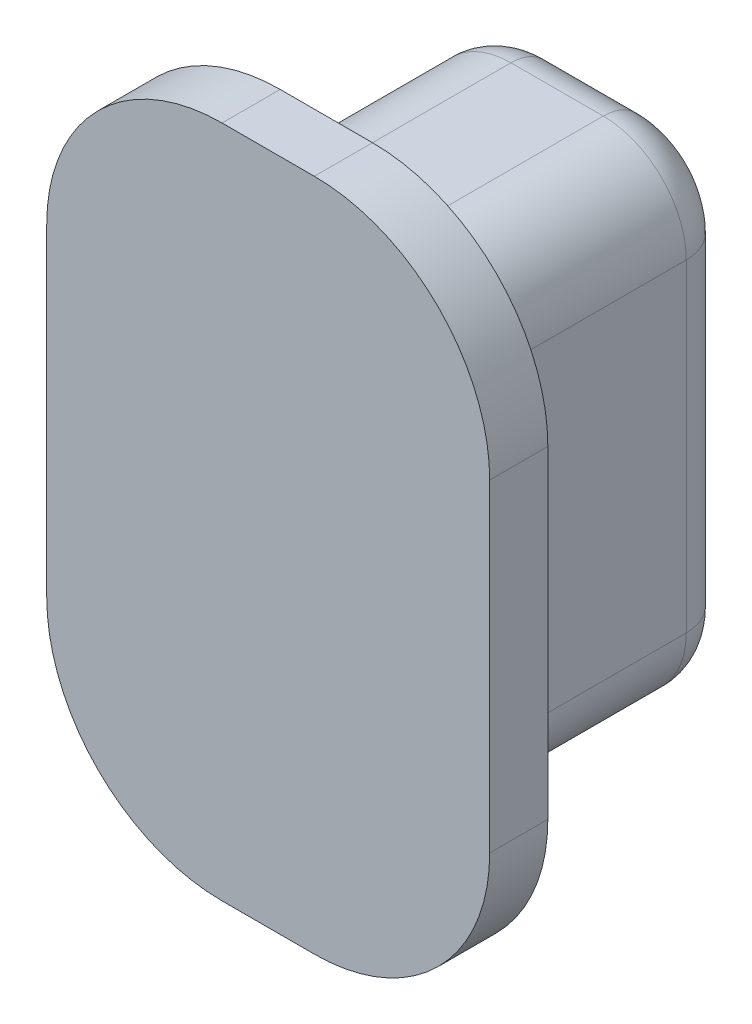
ISO-10303-21;
HEADER;
FILE_DESCRIPTION(('STEP AP214'),'2;1');
FILE_NAME('part.step','',(''),(''),'','','');
FILE_SCHEMA(('AUTOMOTIVE_DESIGN { 1 0 10303 214 1 1 1 1 }'));
ENDSEC;
DATA;
#1=APPLICATION_CONTEXT('core data for automotive mechanical design processes');
#2=APPLICATION_PROTOCOL_DEFINITION('international standard','automotive_design',2000,#1);
#3=PRODUCT_CONTEXT('',#1,'mechanical');
#4=PRODUCT('Part','Part','',(#3));
#5=PRODUCT_RELATED_PRODUCT_CATEGORY('part','',(#4));
#6=PRODUCT_DEFINITION_FORMATION('','',#4);
#7=PRODUCT_DEFINITION_CONTEXT('part definition',#1,'design');
#8=PRODUCT_DEFINITION('design','',#6,#7);
#9=PRODUCT_DEFINITION_SHAPE('','',#8);
#10=(LENGTH_UNIT() NAMED_UNIT(*) SI_UNIT(.MILLI.,.METRE.));
#11=(NAMED_UNIT(*) PLANE_ANGLE_UNIT() SI_UNIT($,.RADIAN.));
#12=(NAMED_UNIT(*) SI_UNIT($,.STERADIAN.) SOLID_ANGLE_UNIT());
#13=UNCERTAINTY_MEASURE_WITH_UNIT(LENGTH_MEASURE(1.E-05),#10,'distance_accuracy_value','');
#14=(GEOMETRIC_REPRESENTATION_CONTEXT(3) GLOBAL_UNCERTAINTY_ASSIGNED_CONTEXT((#13)) GLOBAL_UNIT_ASSIGNED_CONTEXT((#10,
#11,#12)) REPRESENTATION_CONTEXT('',''));
#15=CARTESIAN_POINT('',(0.,0.,0.));
#16=DIRECTION('',(0.,0.,1.));
#17=DIRECTION('',(1.,0.,0.));
#18=AXIS2_PLACEMENT_3D('',#15,#16,#17);
#19=CARTESIAN_POINT('',(0.,0.,-3.));
#20=DIRECTION('',(0.,0.,-1.));
#21=DIRECTION('',(-1.,0.,0.));
#22=AXIS2_PLACEMENT_3D('',#19,#20,#21);
#23=PLANE('',#22);
#24=CARTESIAN_POINT('',(-2.49999999999999,19.3,-3.));
#25=DIRECTION('',(0.,0.,-1.));
#26=DIRECTION('',(-1.,0.,0.));
#27=AXIS2_PLACEMENT_3D('',#24,#25,#26);
#28=CIRCLE('',#27,0.400000000000001);
#29=CARTESIAN_POINT('',(-2.09999999999999,19.3,-3.));
#30=VERTEX_POINT('',#29);
#31=CARTESIAN_POINT('',(-2.49999999999999,18.9,-3.));
#32=VERTEX_POINT('',#31);
#33=EDGE_CURVE('E296',#30,#32,#28,.T.);
#34=ORIENTED_EDGE('',*,*,#33,.T.);
#35=DIRECTION('',(1.,0.,0.));
#36=VECTOR('',#35,1.);
#37=CARTESIAN_POINT('',(0.,18.9,-3.));
#38=LINE('',#37,#36);
#39=CARTESIAN_POINT('',(-3.49999999999999,18.9,-3.));
#40=VERTEX_POINT('',#39);
#41=EDGE_CURVE('E298',#32,#40,#38,.F.);
#42=ORIENTED_EDGE('',*,*,#41,.T.);
#43=CARTESIAN_POINT('',(-3.49999999999999,19.3,-3.));
#44=DIRECTION('',(0.,0.,-1.));
#45=DIRECTION('',(-1.,0.,0.));
#46=AXIS2_PLACEMENT_3D('',#43,#44,#45);
#47=CIRCLE('',#46,0.400000000000001);
#48=CARTESIAN_POINT('',(-3.89999999999999,19.3,-3.));
#49=VERTEX_POINT('',#48);
#50=EDGE_CURVE('E284',#40,#49,#47,.T.);
#51=ORIENTED_EDGE('',*,*,#50,.T.);
#52=DIRECTION('',(0.,-1.,0.));
#53=VECTOR('',#52,1.);
#54=CARTESIAN_POINT('',(-3.89999999999999,0.,-3.));
#55=LINE('',#54,#53);
#56=CARTESIAN_POINT('',(-3.89999999999999,22.8,-3.));
#57=VERTEX_POINT('',#56);
#58=EDGE_CURVE('E286',#49,#57,#55,.F.);
#59=ORIENTED_EDGE('',*,*,#58,.T.);
#60=CARTESIAN_POINT('',(-3.49999999999999,22.8,-3.));
#61=DIRECTION('',(0.,0.,-1.));
#62=DIRECTION('',(-1.,0.,0.));
#63=AXIS2_PLACEMENT_3D('',#60,#61,#62);
#64=CIRCLE('',#63,0.400000000000001);
#65=CARTESIAN_POINT('',(-3.49999999999999,23.2,-3.));
#66=VERTEX_POINT('',#65);
#67=EDGE_CURVE('E288',#57,#66,#64,.T.);
#68=ORIENTED_EDGE('',*,*,#67,.T.);
#69=DIRECTION('',(-1.,0.,0.));
#70=VECTOR('',#69,1.);
#71=CARTESIAN_POINT('',(0.,23.2,-3.));
#72=LINE('',#71,#70);
#73=CARTESIAN_POINT('',(-2.49999999999999,23.2,-3.));
#74=VERTEX_POINT('',#73);
#75=EDGE_CURVE('E290',#66,#74,#72,.F.);
#76=ORIENTED_EDGE('',*,*,#75,.T.);
#77=CARTESIAN_POINT('',(-2.49999999999999,22.8,-3.));
#78=DIRECTION('',(0.,0.,-1.));
#79=DIRECTION('',(-1.,0.,0.));
#80=AXIS2_PLACEMENT_3D('',#77,#78,#79);
#81=CIRCLE('',#80,0.400000000000001);
#82=CARTESIAN_POINT('',(-2.09999999999999,22.8,-3.));
#83=VERTEX_POINT('',#82);
#84=EDGE_CURVE('E292',#74,#83,#81,.T.);
#85=ORIENTED_EDGE('',*,*,#84,.T.);
#86=DIRECTION('',(0.,1.,0.));
#87=VECTOR('',#86,1.);
#88=CARTESIAN_POINT('',(-2.09999999999999,0.,-3.));
#89=LINE('',#88,#87);
#90=EDGE_CURVE('E294',#83,#30,#89,.F.);
#91=ORIENTED_EDGE('',*,*,#90,.T.);
#92=EDGE_LOOP('',(#34,#42,#51,#59,#68,#76,#85,#91));
#93=FACE_BOUND('',#92,.T.);
#94=ADVANCED_FACE('F38',(#93),#23,.T.);
#95=CARTESIAN_POINT('',(-3.49999999999999,18.4,-9.49416382825829));
#96=DIRECTION('',(0.,-1.,0.));
#97=DIRECTION('',(0.,0.,-1.));
#98=AXIS2_PLACEMENT_3D('',#95,#96,#97);
#99=PLANE('',#98);
#100=DIRECTION('',(0.,0.,1.));
#101=VECTOR('',#100,1.);
#102=CARTESIAN_POINT('',(-3.49999999999999,18.4,-9.49416382825829));
#103=LINE('',#102,#101);
#104=CARTESIAN_POINT('',(-3.49999999999999,18.4,-2.5));
#105=VERTEX_POINT('',#104);
#106=CARTESIAN_POINT('',(-3.49999999999999,18.4,0.));
#107=VERTEX_POINT('',#106);
#108=EDGE_CURVE('E268',#105,#107,#103,.T.);
#109=ORIENTED_EDGE('',*,*,#108,.F.);
#110=DIRECTION('',(1.,0.,0.));
#111=VECTOR('',#110,1.);
#112=CARTESIAN_POINT('',(-3.49999999999999,18.4,-2.5));
#113=LINE('',#112,#111);
#114=CARTESIAN_POINT('',(-2.49999999999999,18.4,-2.5));
#115=VERTEX_POINT('',#114);
#116=EDGE_CURVE('E281',#105,#115,#113,.T.);
#117=ORIENTED_EDGE('',*,*,#116,.T.);
#118=DIRECTION('',(0.,0.,1.));
#119=VECTOR('',#118,1.);
#120=CARTESIAN_POINT('',(-2.49999999999999,18.4,-9.49416382825829));
#121=LINE('',#120,#119);
#122=CARTESIAN_POINT('',(-2.49999999999999,18.4,0.));
#123=VERTEX_POINT('',#122);
#124=EDGE_CURVE('E244',#115,#123,#121,.T.);
#125=ORIENTED_EDGE('',*,*,#124,.T.);
#126=DIRECTION('',(1.,0.,0.));
#127=VECTOR('',#126,1.);
#128=CARTESIAN_POINT('',(-3.49999999999999,18.4,0.));
#129=LINE('',#128,#127);
#130=EDGE_CURVE('E260',#107,#123,#129,.T.);
#131=ORIENTED_EDGE('',*,*,#130,.F.);
#132=EDGE_LOOP('',(#109,#117,#125,#131));
#133=FACE_BOUND('',#132,.T.);
#134=ADVANCED_FACE('F388',(#133),#99,.T.);
#135=CARTESIAN_POINT('',(-2.49999999999999,19.3,-9.49416382825829));
#136=DIRECTION('',(0.,0.,1.));
#137=DIRECTION('',(1.,0.,0.));
#138=AXIS2_PLACEMENT_3D('',#135,#136,#137);
#139=CYLINDRICAL_SURFACE('',#138,0.900000000000001);
#140=ORIENTED_EDGE('',*,*,#124,.F.);
#141=CARTESIAN_POINT('',(-2.49999999999999,19.3,-2.5));
#142=DIRECTION('',(0.,0.,-1.));
#143=DIRECTION('',(-1.,0.,0.));
#144=AXIS2_PLACEMENT_3D('',#141,#142,#143);
#145=CIRCLE('',#144,0.900000000000001);
#146=CARTESIAN_POINT('',(-1.59999999999999,19.3,-2.5));
#147=VERTEX_POINT('',#146);
#148=EDGE_CURVE('E301',#115,#147,#145,.F.);
#149=ORIENTED_EDGE('',*,*,#148,.T.);
#150=DIRECTION('',(0.,0.,1.));
#151=VECTOR('',#150,1.);
#152=CARTESIAN_POINT('',(-1.59999999999999,19.3,-9.49416382825829));
#153=LINE('',#152,#151);
#154=CARTESIAN_POINT('',(-1.59999999999999,19.3,0.));
#155=VERTEX_POINT('',#154);
#156=EDGE_CURVE('E277',#147,#155,#153,.T.);
#157=ORIENTED_EDGE('',*,*,#156,.T.);
#158=CARTESIAN_POINT('',(-2.49999999999999,19.3,0.));
#159=DIRECTION('',(0.,0.,1.));
#160=DIRECTION('',(1.,0.,0.));
#161=AXIS2_PLACEMENT_3D('',#158,#159,#160);
#162=CIRCLE('',#161,0.900000000000001);
#163=EDGE_CURVE('E257',#123,#155,#162,.T.);
#164=ORIENTED_EDGE('',*,*,#163,.F.);
#165=EDGE_LOOP('',(#140,#149,#157,#164));
#166=FACE_BOUND('',#165,.T.);
#167=ADVANCED_FACE('F393',(#166),#139,.T.);
#168=CARTESIAN_POINT('',(-1.59999999999999,19.3,-9.49416382825829));
#169=DIRECTION('',(1.,0.,0.));
#170=DIRECTION('',(0.,1.,0.));
#171=AXIS2_PLACEMENT_3D('',#168,#169,#170);
#172=PLANE('',#171);
#173=ORIENTED_EDGE('',*,*,#156,.F.);
#174=DIRECTION('',(0.,1.,0.));
#175=VECTOR('',#174,1.);
#176=CARTESIAN_POINT('',(-1.59999999999999,19.3,-2.5));
#177=LINE('',#176,#175);
#178=CARTESIAN_POINT('',(-1.59999999999999,22.8,-2.5));
#179=VERTEX_POINT('',#178);
#180=EDGE_CURVE('E303',#147,#179,#177,.T.);
#181=ORIENTED_EDGE('',*,*,#180,.T.);
#182=DIRECTION('',(0.,0.,1.));
#183=VECTOR('',#182,1.);
#184=CARTESIAN_POINT('',(-1.59999999999999,22.8,-9.49416382825829));
#185=LINE('',#184,#183);
#186=CARTESIAN_POINT('',(-1.59999999999999,22.8,0.));
#187=VERTEX_POINT('',#186);
#188=EDGE_CURVE('E275',#179,#187,#185,.T.);
#189=ORIENTED_EDGE('',*,*,#188,.T.);
#190=DIRECTION('',(0.,1.,0.));
#191=VECTOR('',#190,1.);
#192=CARTESIAN_POINT('',(-1.59999999999999,19.3,0.));
#193=LINE('',#192,#191);
#194=EDGE_CURVE('E254',#155,#187,#193,.T.);
#195=ORIENTED_EDGE('',*,*,#194,.F.);
#196=EDGE_LOOP('',(#173,#181,#189,#195));
#197=FACE_BOUND('',#196,.T.);
#198=ADVANCED_FACE('F351',(#197),#172,.T.);
#199=CARTESIAN_POINT('',(-2.49999999999999,22.8,-9.49416382825829));
#200=DIRECTION('',(0.,0.,1.));
#201=DIRECTION('',(1.,0.,0.));
#202=AXIS2_PLACEMENT_3D('',#199,#200,#201);
#203=CYLINDRICAL_SURFACE('',#202,0.9);
#204=ORIENTED_EDGE('',*,*,#188,.F.);
#205=CARTESIAN_POINT('',(-2.49999999999999,22.8,-2.5));
#206=DIRECTION('',(0.,0.,-1.));
#207=DIRECTION('',(-1.,0.,0.));
#208=AXIS2_PLACEMENT_3D('',#205,#206,#207);
#209=CIRCLE('',#208,0.9);
#210=CARTESIAN_POINT('',(-2.49999999999999,23.7,-2.5));
#211=VERTEX_POINT('',#210);
#212=EDGE_CURVE('E305',#179,#211,#209,.F.);
#213=ORIENTED_EDGE('',*,*,#212,.T.);
#214=DIRECTION('',(0.,0.,1.));
#215=VECTOR('',#214,1.);
#216=CARTESIAN_POINT('',(-2.49999999999999,23.7,-9.49416382825829));
#217=LINE('',#216,#215);
#218=CARTESIAN_POINT('',(-2.49999999999999,23.7,0.));
#219=VERTEX_POINT('',#218);
#220=EDGE_CURVE('E273',#211,#219,#217,.T.);
#221=ORIENTED_EDGE('',*,*,#220,.T.);
#222=CARTESIAN_POINT('',(-2.49999999999999,22.8,0.));
#223=DIRECTION('',(0.,0.,1.));
#224=DIRECTION('',(1.,0.,0.));
#225=AXIS2_PLACEMENT_3D('',#222,#223,#224);
#226=CIRCLE('',#225,0.9);
#227=EDGE_CURVE('E251',#187,#219,#226,.T.);
#228=ORIENTED_EDGE('',*,*,#227,.F.);
#229=EDGE_LOOP('',(#204,#213,#221,#228));
#230=FACE_BOUND('',#229,.T.);
#231=ADVANCED_FACE('F348',(#230),#203,.T.);
#232=CARTESIAN_POINT('',(-2.49999999999999,23.7,-9.49416382825829));
#233=DIRECTION('',(0.,1.,0.));
#234=DIRECTION('',(0.,0.,1.));
#235=AXIS2_PLACEMENT_3D('',#232,#233,#234);
#236=PLANE('',#235);
#237=ORIENTED_EDGE('',*,*,#220,.F.);
#238=DIRECTION('',(-1.,0.,0.));
#239=VECTOR('',#238,1.);
#240=CARTESIAN_POINT('',(-2.49999999999999,23.7,-2.5));
#241=LINE('',#240,#239);
#242=CARTESIAN_POINT('',(-3.49999999999999,23.7,-2.5));
#243=VERTEX_POINT('',#242);
#244=EDGE_CURVE('E307',#211,#243,#241,.T.);
#245=ORIENTED_EDGE('',*,*,#244,.T.);
#246=DIRECTION('',(0.,0.,1.));
#247=VECTOR('',#246,1.);
#248=CARTESIAN_POINT('',(-3.49999999999999,23.7,-9.49416382825829));
#249=LINE('',#248,#247);
#250=CARTESIAN_POINT('',(-3.49999999999999,23.7,0.));
#251=VERTEX_POINT('',#250);
#252=EDGE_CURVE('E271',#243,#251,#249,.T.);
#253=ORIENTED_EDGE('',*,*,#252,.T.);
#254=DIRECTION('',(-1.,0.,0.));
#255=VECTOR('',#254,1.);
#256=CARTESIAN_POINT('',(-2.49999999999999,23.7,0.));
#257=LINE('',#256,#255);
#258=EDGE_CURVE('E248',#219,#251,#257,.T.);
#259=ORIENTED_EDGE('',*,*,#258,.F.);
#260=EDGE_LOOP('',(#237,#245,#253,#259));
#261=FACE_BOUND('',#260,.T.);
#262=ADVANCED_FACE('F339',(#261),#236,.T.);
#263=CARTESIAN_POINT('',(-3.49999999999999,22.8,-9.49416382825829));
#264=DIRECTION('',(0.,0.,1.));
#265=DIRECTION('',(1.,0.,0.));
#266=AXIS2_PLACEMENT_3D('',#263,#264,#265);
#267=CYLINDRICAL_SURFACE('',#266,0.900000000000001);
#268=ORIENTED_EDGE('',*,*,#252,.F.);
#269=CARTESIAN_POINT('',(-3.49999999999999,22.8,-2.5));
#270=DIRECTION('',(0.,0.,-1.));
#271=DIRECTION('',(-1.,0.,0.));
#272=AXIS2_PLACEMENT_3D('',#269,#270,#271);
#273=CIRCLE('',#272,0.900000000000001);
#274=CARTESIAN_POINT('',(-4.39999999999999,22.8,-2.5));
#275=VERTEX_POINT('',#274);
#276=EDGE_CURVE('E62',#243,#275,#273,.F.);
#277=ORIENTED_EDGE('',*,*,#276,.T.);
#278=DIRECTION('',(0.,0.,1.));
#279=VECTOR('',#278,1.);
#280=CARTESIAN_POINT('',(-4.39999999999999,22.8,-9.49416382825829));
#281=LINE('',#280,#279);
#282=CARTESIAN_POINT('',(-4.39999999999999,22.8,0.));
#283=VERTEX_POINT('',#282);
#284=EDGE_CURVE('E269',#275,#283,#281,.T.);
#285=ORIENTED_EDGE('',*,*,#284,.T.);
#286=CARTESIAN_POINT('',(-3.49999999999999,22.8,0.));
#287=DIRECTION('',(0.,0.,1.));
#288=DIRECTION('',(1.,0.,0.));
#289=AXIS2_PLACEMENT_3D('',#286,#287,#288);
#290=CIRCLE('',#289,0.900000000000001);
#291=EDGE_CURVE('E245',#251,#283,#290,.T.);
#292=ORIENTED_EDGE('',*,*,#291,.F.);
#293=EDGE_LOOP('',(#268,#277,#285,#292));
#294=FACE_BOUND('',#293,.T.);
#295=ADVANCED_FACE('F342',(#294),#267,.T.);
#296=CARTESIAN_POINT('',(-4.39999999999999,22.8,-9.49416382825829));
#297=DIRECTION('',(-1.,0.,0.));
#298=DIRECTION('',(0.,0.,1.));
#299=AXIS2_PLACEMENT_3D('',#296,#297,#298);
#300=PLANE('',#299);
#301=ORIENTED_EDGE('',*,*,#284,.F.);
#302=DIRECTION('',(0.,-1.,0.));
#303=VECTOR('',#302,1.);
#304=CARTESIAN_POINT('',(-4.39999999999999,22.8,-2.5));
#305=LINE('',#304,#303);
#306=CARTESIAN_POINT('',(-4.39999999999999,19.3,-2.5));
#307=VERTEX_POINT('',#306);
#308=EDGE_CURVE('E47',#275,#307,#305,.T.);
#309=ORIENTED_EDGE('',*,*,#308,.T.);
#310=DIRECTION('',(0.,0.,1.));
#311=VECTOR('',#310,1.);
#312=CARTESIAN_POINT('',(-4.39999999999999,19.3,-9.49416382825829));
#313=LINE('',#312,#311);
#314=CARTESIAN_POINT('',(-4.39999999999999,19.3,0.));
#315=VERTEX_POINT('',#314);
#316=EDGE_CURVE('E266',#307,#315,#313,.T.);
#317=ORIENTED_EDGE('',*,*,#316,.T.);
#318=DIRECTION('',(0.,-1.,0.));
#319=VECTOR('',#318,1.);
#320=CARTESIAN_POINT('',(-4.39999999999999,22.8,0.));
#321=LINE('',#320,#319);
#322=EDGE_CURVE('E241',#283,#315,#321,.T.);
#323=ORIENTED_EDGE('',*,*,#322,.F.);
#324=EDGE_LOOP('',(#301,#309,#317,#323));
#325=FACE_BOUND('',#324,.T.);
#326=ADVANCED_FACE('F579',(#325),#300,.T.);
#327=CARTESIAN_POINT('',(-3.49999999999999,19.3,-9.49416382825829));
#328=DIRECTION('',(0.,0.,1.));
#329=DIRECTION('',(1.,0.,0.));
#330=AXIS2_PLACEMENT_3D('',#327,#328,#329);
#331=CYLINDRICAL_SURFACE('',#330,0.900000000000001);
#332=ORIENTED_EDGE('',*,*,#316,.F.);
#333=CARTESIAN_POINT('',(-3.49999999999999,19.3,-2.5));
#334=DIRECTION('',(0.,0.,-1.));
#335=DIRECTION('',(-1.,0.,0.));
#336=AXIS2_PLACEMENT_3D('',#333,#334,#335);
#337=CIRCLE('',#336,0.900000000000001);
#338=EDGE_CURVE('E12',#307,#105,#337,.F.);
#339=ORIENTED_EDGE('',*,*,#338,.T.);
#340=ORIENTED_EDGE('',*,*,#108,.T.);
#341=CARTESIAN_POINT('',(-3.49999999999999,19.3,0.));
#342=DIRECTION('',(0.,0.,1.));
#343=DIRECTION('',(1.,0.,0.));
#344=AXIS2_PLACEMENT_3D('',#341,#342,#343);
#345=CIRCLE('',#344,0.900000000000001);
#346=EDGE_CURVE('E263',#315,#107,#345,.T.);
#347=ORIENTED_EDGE('',*,*,#346,.F.);
#348=EDGE_LOOP('',(#332,#339,#340,#347));
#349=FACE_BOUND('',#348,.T.);
#350=ADVANCED_FACE('F570',(#349),#331,.T.);
#351=CARTESIAN_POINT('',(-3.49999999999999,19.3,0.));
#352=DIRECTION('',(0.,0.,1.));
#353=DIRECTION('',(1.,0.,0.));
#354=AXIS2_PLACEMENT_3D('',#351,#352,#353);
#355=PLANE('',#354);
#356=CARTESIAN_POINT('',(-3.49999999999999,19.3,0.));
#357=DIRECTION('',(0.,0.,1.));
#358=DIRECTION('',(1.,0.,0.));
#359=AXIS2_PLACEMENT_3D('',#356,#357,#358);
#360=CIRCLE('',#359,1.9);
#361=CARTESIAN_POINT('',(-5.39999999999999,19.3,0.));
#362=VERTEX_POINT('',#361);
#363=CARTESIAN_POINT('',(-3.49999999999999,17.4,0.));
#364=VERTEX_POINT('',#363);
#365=EDGE_CURVE('E195',#362,#364,#360,.T.);
#366=ORIENTED_EDGE('',*,*,#365,.F.);
#367=DIRECTION('',(0.,-1.,0.));
#368=VECTOR('',#367,1.);
#369=CARTESIAN_POINT('',(-5.39999999999999,22.8,0.));
#370=LINE('',#369,#368);
#371=CARTESIAN_POINT('',(-5.39999999999999,22.8,0.));
#372=VERTEX_POINT('',#371);
#373=EDGE_CURVE('E224',#372,#362,#370,.T.);
#374=ORIENTED_EDGE('',*,*,#373,.F.);
#375=CARTESIAN_POINT('',(-3.49999999999999,22.8,0.));
#376=DIRECTION('',(0.,0.,1.));
#377=DIRECTION('',(1.,0.,0.));
#378=AXIS2_PLACEMENT_3D('',#375,#376,#377);
#379=CIRCLE('',#378,1.9);
#380=CARTESIAN_POINT('',(-3.49999999999999,24.7,0.));
#381=VERTEX_POINT('',#380);
#382=EDGE_CURVE('E221',#381,#372,#379,.T.);
#383=ORIENTED_EDGE('',*,*,#382,.F.);
#384=DIRECTION('',(-1.,0.,0.));
#385=VECTOR('',#384,1.);
#386=CARTESIAN_POINT('',(-2.49999999999999,24.7,0.));
#387=LINE('',#386,#385);
#388=CARTESIAN_POINT('',(-2.49999999999999,24.7,0.));
#389=VERTEX_POINT('',#388);
#390=EDGE_CURVE('E218',#389,#381,#387,.T.);
#391=ORIENTED_EDGE('',*,*,#390,.F.);
#392=CARTESIAN_POINT('',(-2.49999999999999,22.8,0.));
#393=DIRECTION('',(0.,0.,1.));
#394=DIRECTION('',(1.,0.,0.));
#395=AXIS2_PLACEMENT_3D('',#392,#393,#394);
#396=CIRCLE('',#395,1.9);
#397=CARTESIAN_POINT('',(-0.599999999999991,22.8,0.));
#398=VERTEX_POINT('',#397);
#399=EDGE_CURVE('E215',#398,#389,#396,.T.);
#400=ORIENTED_EDGE('',*,*,#399,.F.);
#401=DIRECTION('',(0.,1.,0.));
#402=VECTOR('',#401,1.);
#403=CARTESIAN_POINT('',(-0.59999999999999,19.3,0.));
#404=LINE('',#403,#402);
#405=CARTESIAN_POINT('',(-0.59999999999999,19.3,0.));
#406=VERTEX_POINT('',#405);
#407=EDGE_CURVE('E212',#406,#398,#404,.T.);
#408=ORIENTED_EDGE('',*,*,#407,.F.);
#409=CARTESIAN_POINT('',(-2.49999999999999,19.3,0.));
#410=DIRECTION('',(0.,0.,1.));
#411=DIRECTION('',(1.,0.,0.));
#412=AXIS2_PLACEMENT_3D('',#409,#410,#411);
#413=CIRCLE('',#412,1.9);
#414=CARTESIAN_POINT('',(-2.49999999999999,17.4,0.));
#415=VERTEX_POINT('',#414);
#416=EDGE_CURVE('E198',#415,#406,#413,.T.);
#417=ORIENTED_EDGE('',*,*,#416,.F.);
#418=DIRECTION('',(1.,0.,0.));
#419=VECTOR('',#418,1.);
#420=CARTESIAN_POINT('',(-3.49999999999999,17.4,0.));
#421=LINE('',#420,#419);
#422=EDGE_CURVE('E181',#364,#415,#421,.T.);
#423=ORIENTED_EDGE('',*,*,#422,.F.);
#424=EDGE_LOOP('',(#366,#374,#383,#391,#400,#408,#417,#423));
#425=FACE_BOUND('',#424,.T.);
#426=ORIENTED_EDGE('',*,*,#322,.T.);
#427=ORIENTED_EDGE('',*,*,#346,.T.);
#428=ORIENTED_EDGE('',*,*,#130,.T.);
#429=ORIENTED_EDGE('',*,*,#163,.T.);
#430=ORIENTED_EDGE('',*,*,#194,.T.);
#431=ORIENTED_EDGE('',*,*,#227,.T.);
#432=ORIENTED_EDGE('',*,*,#258,.T.);
#433=ORIENTED_EDGE('',*,*,#291,.T.);
#434=EDGE_LOOP('',(#426,#427,#428,#429,#430,#431,#432,#433));
#435=FACE_BOUND('',#434,.T.);
#436=ADVANCED_FACE('F192',(#425,#435),#355,.F.);
#437=CARTESIAN_POINT('',(-5.39999999999999,22.8,9.46670418407308));
#438=DIRECTION('',(1.,0.,0.));
#439=DIRECTION('',(0.,0.,-1.));
#440=AXIS2_PLACEMENT_3D('',#437,#438,#439);
#441=PLANE('',#440);
#442=DIRECTION('',(0.,0.,-1.));
#443=VECTOR('',#442,1.);
#444=CARTESIAN_POINT('',(-5.39999999999999,19.3,9.46670418407308));
#445=LINE('',#444,#443);
#446=CARTESIAN_POINT('',(-5.39999999999999,19.3,0.630000000000001));
#447=VERTEX_POINT('',#446);
#448=EDGE_CURVE('E202',#447,#362,#445,.T.);
#449=ORIENTED_EDGE('',*,*,#448,.F.);
#450=DIRECTION('',(0.,1.,0.));
#451=VECTOR('',#450,1.);
#452=CARTESIAN_POINT('',(-5.39999999999999,22.8,0.63));
#453=LINE('',#452,#451);
#454=CARTESIAN_POINT('',(-5.39999999999999,22.8,0.63));
#455=VERTEX_POINT('',#454);
#456=EDGE_CURVE('E187',#447,#455,#453,.T.);
#457=ORIENTED_EDGE('',*,*,#456,.T.);
#458=DIRECTION('',(0.,0.,-1.));
#459=VECTOR('',#458,1.);
#460=CARTESIAN_POINT('',(-5.39999999999999,22.8,9.46670418407308));
#461=LINE('',#460,#459);
#462=EDGE_CURVE('E227',#455,#372,#461,.T.);
#463=ORIENTED_EDGE('',*,*,#462,.T.);
#464=ORIENTED_EDGE('',*,*,#373,.T.);
#465=EDGE_LOOP('',(#449,#457,#463,#464));
#466=FACE_BOUND('',#465,.T.);
#467=ADVANCED_FACE('F549',(#466),#441,.F.);
#468=CARTESIAN_POINT('',(-3.49999999999999,22.8,9.46670418407308));
#469=DIRECTION('',(0.,0.,-1.));
#470=DIRECTION('',(-1.,0.,0.));
#471=AXIS2_PLACEMENT_3D('',#468,#469,#470);
#472=CYLINDRICAL_SURFACE('',#471,1.9);
#473=ORIENTED_EDGE('',*,*,#462,.F.);
#474=CARTESIAN_POINT('',(-3.49999999999999,22.8,0.63));
#475=DIRECTION('',(0.,0.,-1.));
#476=DIRECTION('',(0.,1.,0.));
#477=AXIS2_PLACEMENT_3D('',#474,#475,#476);
#478=CIRCLE('',#477,1.9);
#479=CARTESIAN_POINT('',(-3.49999999999999,24.7,0.63));
#480=VERTEX_POINT('',#479);
#481=EDGE_CURVE('E240',#455,#480,#478,.T.);
#482=ORIENTED_EDGE('',*,*,#481,.T.);
#483=DIRECTION('',(0.,0.,-1.));
#484=VECTOR('',#483,1.);
#485=CARTESIAN_POINT('',(-3.49999999999999,24.7,9.46670418407308));
#486=LINE('',#485,#484);
#487=EDGE_CURVE('E229',#480,#381,#486,.T.);
#488=ORIENTED_EDGE('',*,*,#487,.T.);
#489=ORIENTED_EDGE('',*,*,#382,.T.);
#490=EDGE_LOOP('',(#473,#482,#488,#489));
#491=FACE_BOUND('',#490,.T.);
#492=ADVANCED_FACE('F538',(#491),#472,.T.);
#493=CARTESIAN_POINT('',(-2.49999999999999,24.7,9.46670418407308));
#494=DIRECTION('',(0.,-1.,0.));
#495=DIRECTION('',(1.,0.,0.));
#496=AXIS2_PLACEMENT_3D('',#493,#494,#495);
#497=PLANE('',#496);
#498=ORIENTED_EDGE('',*,*,#487,.F.);
#499=DIRECTION('',(1.,0.,0.));
#500=VECTOR('',#499,1.);
#501=CARTESIAN_POINT('',(-2.49999999999999,24.7,0.63));
#502=LINE('',#501,#500);
#503=CARTESIAN_POINT('',(-2.49999999999999,24.7,0.63));
#504=VERTEX_POINT('',#503);
#505=EDGE_CURVE('E682',#480,#504,#502,.T.);
#506=ORIENTED_EDGE('',*,*,#505,.T.);
#507=DIRECTION('',(0.,0.,-1.));
#508=VECTOR('',#507,1.);
#509=CARTESIAN_POINT('',(-2.49999999999999,24.7,9.46670418407308));
#510=LINE('',#509,#508);
#511=EDGE_CURVE('E231',#504,#389,#510,.T.);
#512=ORIENTED_EDGE('',*,*,#511,.T.);
#513=ORIENTED_EDGE('',*,*,#390,.T.);
#514=EDGE_LOOP('',(#498,#506,#512,#513));
#515=FACE_BOUND('',#514,.T.);
#516=ADVANCED_FACE('F527',(#515),#497,.F.);
#517=CARTESIAN_POINT('',(-2.49999999999999,22.8,9.46670418407308));
#518=DIRECTION('',(0.,0.,-1.));
#519=DIRECTION('',(-1.,0.,0.));
#520=AXIS2_PLACEMENT_3D('',#517,#518,#519);
#521=CYLINDRICAL_SURFACE('',#520,1.9);
#522=ORIENTED_EDGE('',*,*,#511,.F.);
#523=CARTESIAN_POINT('',(-2.49999999999999,22.8,0.63));
#524=DIRECTION('',(0.,0.,-1.));
#525=DIRECTION('',(0.,1.,0.));
#526=AXIS2_PLACEMENT_3D('',#523,#524,#525);
#527=CIRCLE('',#526,1.9);
#528=CARTESIAN_POINT('',(-0.599999999999991,22.8,0.63));
#529=VERTEX_POINT('',#528);
#530=EDGE_CURVE('E691',#504,#529,#527,.T.);
#531=ORIENTED_EDGE('',*,*,#530,.T.);
#532=DIRECTION('',(0.,0.,-1.));
#533=VECTOR('',#532,1.);
#534=CARTESIAN_POINT('',(-0.599999999999991,22.8,9.46670418407308));
#535=LINE('',#534,#533);
#536=EDGE_CURVE('E233',#529,#398,#535,.T.);
#537=ORIENTED_EDGE('',*,*,#536,.T.);
#538=ORIENTED_EDGE('',*,*,#399,.T.);
#539=EDGE_LOOP('',(#522,#531,#537,#538));
#540=FACE_BOUND('',#539,.T.);
#541=ADVANCED_FACE('F516',(#540),#521,.T.);
#542=CARTESIAN_POINT('',(-0.59999999999999,19.3,9.46670418407308));
#543=DIRECTION('',(-1.,0.,0.));
#544=DIRECTION('',(0.,-1.,0.));
#545=AXIS2_PLACEMENT_3D('',#542,#543,#544);
#546=PLANE('',#545);
#547=ORIENTED_EDGE('',*,*,#536,.F.);
#548=DIRECTION('',(0.,-1.,0.));
#549=VECTOR('',#548,1.);
#550=CARTESIAN_POINT('',(-0.59999999999999,19.3,0.630000000000002));
#551=LINE('',#550,#549);
#552=CARTESIAN_POINT('',(-0.59999999999999,19.3,0.630000000000002));
#553=VERTEX_POINT('',#552);
#554=EDGE_CURVE('E687',#529,#553,#551,.T.);
#555=ORIENTED_EDGE('',*,*,#554,.T.);
#556=DIRECTION('',(0.,0.,-1.));
#557=VECTOR('',#556,1.);
#558=CARTESIAN_POINT('',(-0.59999999999999,19.3,9.46670418407308));
#559=LINE('',#558,#557);
#560=EDGE_CURVE('E235',#553,#406,#559,.T.);
#561=ORIENTED_EDGE('',*,*,#560,.T.);
#562=ORIENTED_EDGE('',*,*,#407,.T.);
#563=EDGE_LOOP('',(#547,#555,#561,#562));
#564=FACE_BOUND('',#563,.T.);
#565=ADVANCED_FACE('F505',(#564),#546,.F.);
#566=CARTESIAN_POINT('',(-2.49999999999999,19.3,9.46670418407308));
#567=DIRECTION('',(0.,0.,-1.));
#568=DIRECTION('',(-1.,0.,0.));
#569=AXIS2_PLACEMENT_3D('',#566,#567,#568);
#570=CYLINDRICAL_SURFACE('',#569,1.9);
#571=ORIENTED_EDGE('',*,*,#560,.F.);
#572=CARTESIAN_POINT('',(-2.49999999999999,19.3,0.630000000000002));
#573=DIRECTION('',(0.,0.,-1.));
#574=DIRECTION('',(0.,1.,0.));
#575=AXIS2_PLACEMENT_3D('',#572,#573,#574);
#576=CIRCLE('',#575,1.9);
#577=CARTESIAN_POINT('',(-2.49999999999999,17.4,0.630000000000002));
#578=VERTEX_POINT('',#577);
#579=EDGE_CURVE('E689',#553,#578,#576,.T.);
#580=ORIENTED_EDGE('',*,*,#579,.T.);
#581=DIRECTION('',(0.,0.,-1.));
#582=VECTOR('',#581,1.);
#583=CARTESIAN_POINT('',(-2.49999999999999,17.4,9.46670418407308));
#584=LINE('',#583,#582);
#585=EDGE_CURVE('E188',#578,#415,#584,.T.);
#586=ORIENTED_EDGE('',*,*,#585,.T.);
#587=ORIENTED_EDGE('',*,*,#416,.T.);
#588=EDGE_LOOP('',(#571,#580,#586,#587));
#589=FACE_BOUND('',#588,.T.);
#590=ADVANCED_FACE('F495',(#589),#570,.T.);
#591=CARTESIAN_POINT('',(-3.49999999999999,17.4,9.46670418407308));
#592=DIRECTION('',(0.,1.,0.));
#593=DIRECTION('',(0.,0.,1.));
#594=AXIS2_PLACEMENT_3D('',#591,#592,#593);
#595=PLANE('',#594);
#596=ORIENTED_EDGE('',*,*,#585,.F.);
#597=DIRECTION('',(-1.,0.,0.));
#598=VECTOR('',#597,1.);
#599=CARTESIAN_POINT('',(-3.49999999999999,17.4,0.630000000000002));
#600=LINE('',#599,#598);
#601=CARTESIAN_POINT('',(-3.49999999999999,17.4,0.630000000000002));
#602=VERTEX_POINT('',#601);
#603=EDGE_CURVE('E183',#578,#602,#600,.T.);
#604=ORIENTED_EDGE('',*,*,#603,.T.);
#605=DIRECTION('',(0.,0.,-1.));
#606=VECTOR('',#605,1.);
#607=CARTESIAN_POINT('',(-3.49999999999999,17.4,9.46670418407308));
#608=LINE('',#607,#606);
#609=EDGE_CURVE('E177',#602,#364,#608,.T.);
#610=ORIENTED_EDGE('',*,*,#609,.T.);
#611=ORIENTED_EDGE('',*,*,#422,.T.);
#612=EDGE_LOOP('',(#596,#604,#610,#611));
#613=FACE_BOUND('',#612,.T.);
#614=ADVANCED_FACE('F180',(#613),#595,.F.);
#615=CARTESIAN_POINT('',(-3.49999999999999,19.3,9.46670418407308));
#616=DIRECTION('',(0.,0.,-1.));
#617=DIRECTION('',(-1.,0.,0.));
#618=AXIS2_PLACEMENT_3D('',#615,#616,#617);
#619=CYLINDRICAL_SURFACE('',#618,1.9);
#620=ORIENTED_EDGE('',*,*,#609,.F.);
#621=CARTESIAN_POINT('',(-3.49999999999999,19.3,0.630000000000002));
#622=DIRECTION('',(0.,0.,-1.));
#623=DIRECTION('',(0.,1.,0.));
#624=AXIS2_PLACEMENT_3D('',#621,#622,#623);
#625=CIRCLE('',#624,1.9);
#626=EDGE_CURVE('E208',#602,#447,#625,.T.);
#627=ORIENTED_EDGE('',*,*,#626,.T.);
#628=ORIENTED_EDGE('',*,*,#448,.T.);
#629=ORIENTED_EDGE('',*,*,#365,.T.);
#630=EDGE_LOOP('',(#620,#627,#628,#629));
#631=FACE_BOUND('',#630,.T.);
#632=ADVANCED_FACE('F200',(#631),#619,.T.);
#633=CARTESIAN_POINT('',(-0.999999999999997,0.,0.630000000000003));
#634=DIRECTION('',(0.,0.,-1.));
#635=DIRECTION('',(0.,-1.,0.));
#636=AXIS2_PLACEMENT_3D('',#633,#634,#635);
#637=PLANE('',#636);
#638=ORIENTED_EDGE('',*,*,#603,.F.);
#639=ORIENTED_EDGE('',*,*,#579,.F.);
#640=ORIENTED_EDGE('',*,*,#554,.F.);
#641=ORIENTED_EDGE('',*,*,#530,.F.);
#642=ORIENTED_EDGE('',*,*,#505,.F.);
#643=ORIENTED_EDGE('',*,*,#481,.F.);
#644=ORIENTED_EDGE('',*,*,#456,.F.);
#645=ORIENTED_EDGE('',*,*,#626,.F.);
#646=EDGE_LOOP('',(#638,#639,#640,#641,#642,#643,#644,#645));
#647=FACE_BOUND('',#646,.T.);
#648=ADVANCED_FACE('F386',(#647),#637,.F.);
#649=CARTESIAN_POINT('',(-2.49999999999999,23.2,-2.5));
#650=DIRECTION('',(-1.,0.,0.));
#651=DIRECTION('',(0.,0.,1.));
#652=AXIS2_PLACEMENT_3D('',#649,#650,#651);
#653=CYLINDRICAL_SURFACE('',#652,0.5);
#654=CARTESIAN_POINT('',(-2.49999999999999,23.2,-2.5));
#655=DIRECTION('',(1.,0.,0.));
#656=DIRECTION('',(0.,0.,-1.));
#657=AXIS2_PLACEMENT_3D('',#654,#655,#656);
#658=CIRCLE('',#657,0.5);
#659=EDGE_CURVE('E206',#74,#211,#658,.T.);
#660=ORIENTED_EDGE('',*,*,#659,.F.);
#661=ORIENTED_EDGE('',*,*,#75,.F.);
#662=CARTESIAN_POINT('',(-3.49999999999999,23.2,-2.5));
#663=DIRECTION('',(-1.,0.,0.));
#664=DIRECTION('',(0.,0.,1.));
#665=AXIS2_PLACEMENT_3D('',#662,#663,#664);
#666=CIRCLE('',#665,0.5);
#667=EDGE_CURVE('E42',#243,#66,#666,.T.);
#668=ORIENTED_EDGE('',*,*,#667,.F.);
#669=ORIENTED_EDGE('',*,*,#244,.F.);
#670=EDGE_LOOP('',(#660,#661,#668,#669));
#671=FACE_BOUND('',#670,.T.);
#672=ADVANCED_FACE('F40',(#671),#653,.T.);
#673=CARTESIAN_POINT('',(-3.49999999999999,22.8,-2.5));
#674=DIRECTION('',(0.,0.,-1.));
#675=DIRECTION('',(-1.,0.,0.));
#676=AXIS2_PLACEMENT_3D('',#673,#674,#675);
#677=DEGENERATE_TOROIDAL_SURFACE('',#676,0.400000000000001,0.5,.T.);
#678=ORIENTED_EDGE('',*,*,#667,.T.);
#679=ORIENTED_EDGE('',*,*,#67,.F.);
#680=CARTESIAN_POINT('',(-3.89999999999999,22.8,-2.5));
#681=DIRECTION('',(0.,-1.,0.));
#682=DIRECTION('',(0.,0.,-1.));
#683=AXIS2_PLACEMENT_3D('',#680,#681,#682);
#684=CIRCLE('',#683,0.5);
#685=EDGE_CURVE('E324',#275,#57,#684,.T.);
#686=ORIENTED_EDGE('',*,*,#685,.F.);
#687=ORIENTED_EDGE('',*,*,#276,.F.);
#688=EDGE_LOOP('',(#678,#679,#686,#687));
#689=FACE_BOUND('',#688,.T.);
#690=ADVANCED_FACE('F379',(#689),#677,.T.);
#691=CARTESIAN_POINT('',(-2.49999999999999,22.8,-2.5));
#692=DIRECTION('',(0.,0.,-1.));
#693=DIRECTION('',(-1.,0.,0.));
#694=AXIS2_PLACEMENT_3D('',#691,#692,#693);
#695=DEGENERATE_TOROIDAL_SURFACE('',#694,0.400000000000001,0.5,.T.);
#696=ORIENTED_EDGE('',*,*,#659,.T.);
#697=ORIENTED_EDGE('',*,*,#212,.F.);
#698=CARTESIAN_POINT('',(-2.09999999999999,22.8,-2.5));
#699=DIRECTION('',(0.,-1.,0.));
#700=DIRECTION('',(0.,0.,-1.));
#701=AXIS2_PLACEMENT_3D('',#698,#699,#700);
#702=CIRCLE('',#701,0.5);
#703=EDGE_CURVE('E321',#83,#179,#702,.T.);
#704=ORIENTED_EDGE('',*,*,#703,.F.);
#705=ORIENTED_EDGE('',*,*,#84,.F.);
#706=EDGE_LOOP('',(#696,#697,#704,#705));
#707=FACE_BOUND('',#706,.T.);
#708=ADVANCED_FACE('F331',(#707),#695,.T.);
#709=CARTESIAN_POINT('',(-3.89999999999999,22.8,-2.5));
#710=DIRECTION('',(0.,-1.,0.));
#711=DIRECTION('',(0.,0.,-1.));
#712=AXIS2_PLACEMENT_3D('',#709,#710,#711);
#713=CYLINDRICAL_SURFACE('',#712,0.5);
#714=ORIENTED_EDGE('',*,*,#685,.T.);
#715=ORIENTED_EDGE('',*,*,#58,.F.);
#716=CARTESIAN_POINT('',(-3.89999999999999,19.3,-2.5));
#717=DIRECTION('',(0.,-1.,0.));
#718=DIRECTION('',(0.,0.,-1.));
#719=AXIS2_PLACEMENT_3D('',#716,#717,#718);
#720=CIRCLE('',#719,0.5);
#721=EDGE_CURVE('E318',#307,#49,#720,.T.);
#722=ORIENTED_EDGE('',*,*,#721,.F.);
#723=ORIENTED_EDGE('',*,*,#308,.F.);
#724=EDGE_LOOP('',(#714,#715,#722,#723));
#725=FACE_BOUND('',#724,.T.);
#726=ADVANCED_FACE('F376',(#725),#713,.T.);
#727=CARTESIAN_POINT('',(-2.09999999999999,19.3,-2.5));
#728=DIRECTION('',(0.,1.,0.));
#729=DIRECTION('',(-1.,0.,0.));
#730=AXIS2_PLACEMENT_3D('',#727,#728,#729);
#731=CYLINDRICAL_SURFACE('',#730,0.5);
#732=ORIENTED_EDGE('',*,*,#703,.T.);
#733=ORIENTED_EDGE('',*,*,#180,.F.);
#734=CARTESIAN_POINT('',(-2.09999999999999,19.3,-2.5));
#735=DIRECTION('',(0.,-1.,0.));
#736=DIRECTION('',(0.,0.,-1.));
#737=AXIS2_PLACEMENT_3D('',#734,#735,#736);
#738=CIRCLE('',#737,0.5);
#739=EDGE_CURVE('E315',#30,#147,#738,.T.);
#740=ORIENTED_EDGE('',*,*,#739,.F.);
#741=ORIENTED_EDGE('',*,*,#90,.F.);
#742=EDGE_LOOP('',(#732,#733,#740,#741));
#743=FACE_BOUND('',#742,.T.);
#744=ADVANCED_FACE('F355',(#743),#731,.T.);
#745=CARTESIAN_POINT('',(-3.49999999999999,19.3,-2.5));
#746=DIRECTION('',(0.,0.,-1.));
#747=DIRECTION('',(-1.,0.,0.));
#748=AXIS2_PLACEMENT_3D('',#745,#746,#747);
#749=DEGENERATE_TOROIDAL_SURFACE('',#748,0.400000000000001,0.5,.T.);
#750=ORIENTED_EDGE('',*,*,#721,.T.);
#751=ORIENTED_EDGE('',*,*,#50,.F.);
#752=CARTESIAN_POINT('',(-3.49999999999999,18.9,-2.5));
#753=DIRECTION('',(1.,0.,0.));
#754=DIRECTION('',(0.,0.,-1.));
#755=AXIS2_PLACEMENT_3D('',#752,#753,#754);
#756=CIRCLE('',#755,0.5);
#757=EDGE_CURVE('E313',#105,#40,#756,.T.);
#758=ORIENTED_EDGE('',*,*,#757,.F.);
#759=ORIENTED_EDGE('',*,*,#338,.F.);
#760=EDGE_LOOP('',(#750,#751,#758,#759));
#761=FACE_BOUND('',#760,.T.);
#762=ADVANCED_FACE('F371',(#761),#749,.T.);
#763=CARTESIAN_POINT('',(-2.49999999999999,19.3,-2.5));
#764=DIRECTION('',(0.,0.,-1.));
#765=DIRECTION('',(-1.,0.,0.));
#766=AXIS2_PLACEMENT_3D('',#763,#764,#765);
#767=DEGENERATE_TOROIDAL_SURFACE('',#766,0.400000000000001,0.5,.T.);
#768=ORIENTED_EDGE('',*,*,#739,.T.);
#769=ORIENTED_EDGE('',*,*,#148,.F.);
#770=CARTESIAN_POINT('',(-2.49999999999999,18.9,-2.5));
#771=DIRECTION('',(-1.,0.,0.));
#772=DIRECTION('',(0.,0.,1.));
#773=AXIS2_PLACEMENT_3D('',#770,#771,#772);
#774=CIRCLE('',#773,0.5);
#775=EDGE_CURVE('E311',#32,#115,#774,.T.);
#776=ORIENTED_EDGE('',*,*,#775,.F.);
#777=ORIENTED_EDGE('',*,*,#33,.F.);
#778=EDGE_LOOP('',(#768,#769,#776,#777));
#779=FACE_BOUND('',#778,.T.);
#780=ADVANCED_FACE('F360',(#779),#767,.T.);
#781=CARTESIAN_POINT('',(-3.49999999999999,18.9,-2.5));
#782=DIRECTION('',(1.,0.,0.));
#783=DIRECTION('',(0.,0.,-1.));
#784=AXIS2_PLACEMENT_3D('',#781,#782,#783);
#785=CYLINDRICAL_SURFACE('',#784,0.5);
#786=ORIENTED_EDGE('',*,*,#757,.T.);
#787=ORIENTED_EDGE('',*,*,#41,.F.);
#788=ORIENTED_EDGE('',*,*,#775,.T.);
#789=ORIENTED_EDGE('',*,*,#116,.F.);
#790=EDGE_LOOP('',(#786,#787,#788,#789));
#791=FACE_BOUND('',#790,.T.);
#792=ADVANCED_FACE('F365',(#791),#785,.T.);
#793=CLOSED_SHELL('',(#94,#134,#167,#198,#231,#262,#295,#326,#350,#436,#467,#492,#516,#541,#565,
#590,#614,#632,#648,#672,#690,#708,#726,#744,#762,#780,#792));
#794=MANIFOLD_SOLID_BREP('B2',#793);
#795=ADVANCED_BREP_SHAPE_REPRESENTATION('',(#18,#794),#14);
#796=SHAPE_DEFINITION_REPRESENTATION(#9,#795);
ENDSEC;
END-ISO-10303-21;
